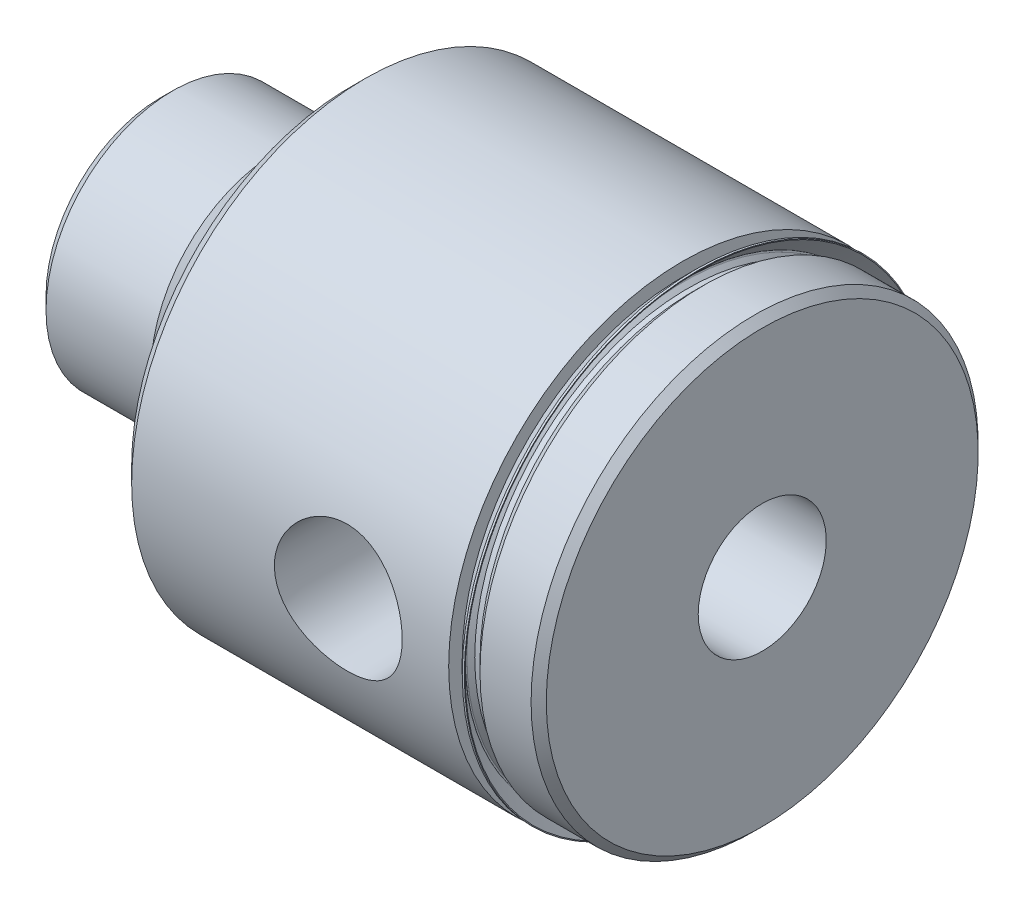
ISO-10303-21;
HEADER;
FILE_DESCRIPTION(('STEP AP214'),'2;1');
FILE_NAME('part.step','',(''),(''),'','','');
FILE_SCHEMA(('AUTOMOTIVE_DESIGN { 1 0 10303 214 1 1 1 1 }'));
ENDSEC;
DATA;
#1=APPLICATION_CONTEXT('core data for automotive mechanical design processes');
#2=APPLICATION_PROTOCOL_DEFINITION('international standard','automotive_design',2000,#1);
#3=PRODUCT_CONTEXT('',#1,'mechanical');
#4=PRODUCT('Part','Part','',(#3));
#5=PRODUCT_RELATED_PRODUCT_CATEGORY('part','',(#4));
#6=PRODUCT_DEFINITION_FORMATION('','',#4);
#7=PRODUCT_DEFINITION_CONTEXT('part definition',#1,'design');
#8=PRODUCT_DEFINITION('design','',#6,#7);
#9=PRODUCT_DEFINITION_SHAPE('','',#8);
#10=(LENGTH_UNIT() NAMED_UNIT(*) SI_UNIT(.MILLI.,.METRE.));
#11=(NAMED_UNIT(*) PLANE_ANGLE_UNIT() SI_UNIT($,.RADIAN.));
#12=(NAMED_UNIT(*) SI_UNIT($,.STERADIAN.) SOLID_ANGLE_UNIT());
#13=UNCERTAINTY_MEASURE_WITH_UNIT(LENGTH_MEASURE(1.E-05),#10,'distance_accuracy_value','');
#14=(GEOMETRIC_REPRESENTATION_CONTEXT(3) GLOBAL_UNCERTAINTY_ASSIGNED_CONTEXT((#13)) GLOBAL_UNIT_ASSIGNED_CONTEXT((#10,
#11,#12)) REPRESENTATION_CONTEXT('',''));
#15=CARTESIAN_POINT('',(0.,0.,0.));
#16=DIRECTION('',(0.,0.,1.));
#17=DIRECTION('',(1.,0.,0.));
#18=AXIS2_PLACEMENT_3D('',#15,#16,#17);
#19=CARTESIAN_POINT('',(52.3367,23.42515,0.));
#20=DIRECTION('',(-1.,0.,0.));
#21=DIRECTION('',(0.,0.,1.));
#22=AXIS2_PLACEMENT_3D('',#19,#20,#21);
#23=PLANE('',#22);
#24=CARTESIAN_POINT('',(52.3367,0.,0.));
#25=DIRECTION('',(-1.,0.,0.));
#26=DIRECTION('',(0.,0.,1.));
#27=AXIS2_PLACEMENT_3D('',#24,#25,#26);
#28=CIRCLE('',#27,23.42515);
#29=CARTESIAN_POINT('',(52.3367,0.,23.42515));
#30=VERTEX_POINT('',#29);
#31=EDGE_CURVE('E220',#30,#30,#28,.T.);
#32=ORIENTED_EDGE('',*,*,#31,.F.);
#33=EDGE_LOOP('',(#32));
#34=FACE_BOUND('',#33,.T.);
#35=CARTESIAN_POINT('',(52.3367,0.,0.));
#36=DIRECTION('',(-1.,0.,0.));
#37=DIRECTION('',(0.,0.,1.));
#38=AXIS2_PLACEMENT_3D('',#35,#36,#37);
#39=CIRCLE('',#38,22.066340711972);
#40=CARTESIAN_POINT('',(52.3367,0.,22.066340711972));
#41=VERTEX_POINT('',#40);
#42=EDGE_CURVE('E11',#41,#41,#39,.F.);
#43=ORIENTED_EDGE('',*,*,#42,.F.);
#44=EDGE_LOOP('',(#43));
#45=FACE_BOUND('',#44,.T.);
#46=ADVANCED_FACE('F38',(#34,#45),#23,.F.);
#47=CARTESIAN_POINT('',(60.325,0.,0.));
#48=DIRECTION('',(-1.,0.,0.));
#49=DIRECTION('',(0.,0.,1.));
#50=AXIS2_PLACEMENT_3D('',#47,#48,#49);
#51=CYLINDRICAL_SURFACE('',#50,21.34235);
#52=CARTESIAN_POINT('',(53.3908,0.,0.));
#53=DIRECTION('',(-1.,0.,0.));
#54=DIRECTION('',(0.,0.,1.));
#55=AXIS2_PLACEMENT_3D('',#52,#53,#54);
#56=CIRCLE('',#55,21.34235);
#57=CARTESIAN_POINT('',(53.3908,0.,21.34235));
#58=VERTEX_POINT('',#57);
#59=EDGE_CURVE('E217',#58,#58,#56,.T.);
#60=ORIENTED_EDGE('',*,*,#59,.T.);
#61=EDGE_LOOP('',(#60));
#62=FACE_BOUND('',#61,.T.);
#63=CARTESIAN_POINT('',(52.86375,0.,0.));
#64=DIRECTION('',(-1.,0.,0.));
#65=DIRECTION('',(0.,0.,1.));
#66=AXIS2_PLACEMENT_3D('',#63,#64,#65);
#67=CIRCLE('',#66,21.34235);
#68=CARTESIAN_POINT('',(52.86375,0.,21.34235));
#69=VERTEX_POINT('',#68);
#70=EDGE_CURVE('E46',#69,#69,#67,.T.);
#71=ORIENTED_EDGE('',*,*,#70,.F.);
#72=EDGE_LOOP('',(#71));
#73=FACE_BOUND('',#72,.T.);
#74=ADVANCED_FACE('F121',(#62,#73),#51,.T.);
#75=CARTESIAN_POINT('',(60.325,0.,0.));
#76=DIRECTION('',(-1.,0.,0.));
#77=DIRECTION('',(0.,0.,1.));
#78=AXIS2_PLACEMENT_3D('',#75,#76,#77);
#79=CYLINDRICAL_SURFACE('',#78,23.42515);
#80=CARTESIAN_POINT('',(20.574,0.,0.));
#81=DIRECTION('',(-1.,0.,0.));
#82=DIRECTION('',(0.,0.,1.));
#83=AXIS2_PLACEMENT_3D('',#80,#81,#82);
#84=CIRCLE('',#83,23.42515);
#85=CARTESIAN_POINT('',(20.574,0.,23.42515));
#86=VERTEX_POINT('',#85);
#87=EDGE_CURVE('E223',#86,#86,#84,.T.);
#88=ORIENTED_EDGE('',*,*,#87,.F.);
#89=EDGE_LOOP('',(#88));
#90=FACE_BOUND('',#89,.T.);
#91=ORIENTED_EDGE('',*,*,#31,.T.);
#92=EDGE_LOOP('',(#91));
#93=FACE_BOUND('',#92,.T.);
#94=CARTESIAN_POINT('',(36.9115790649835,-4.6646689271702,22.9560126398815));
#95=CARTESIAN_POINT('',(37.173715264647,-4.90774911775853,22.9066184768419));
#96=CARTESIAN_POINT('',(37.4564019085562,-5.12892348529612,22.857650792634));
#97=CARTESIAN_POINT('',(38.0555408423936,-5.52143569545501,22.7660323083869));
#98=CARTESIAN_POINT('',(38.3720053279649,-5.69275545408309,22.7233838032794));
#99=CARTESIAN_POINT('',(39.03058577615,-5.98065838622947,22.649317456565));
#100=CARTESIAN_POINT('',(39.3727291776588,-6.09718201391934,22.6179118411787));
#101=CARTESIAN_POINT('',(40.0728635162713,-6.27133040600587,22.57025597372));
#102=CARTESIAN_POINT('',(40.4308497557359,-6.32897250918489,22.5540012603005));
#103=CARTESIAN_POINT('',(40.9669130571281,-6.36947724435374,22.5425686346015));
#104=CARTESIAN_POINT('',(41.1434033341198,-6.37550425760518,22.5408639013015));
#105=CARTESIAN_POINT('',(41.496259171692,-6.37303380583479,22.5415649075011));
#106=CARTESIAN_POINT('',(41.6726247542753,-6.36454166130358,22.543969141285));
#107=CARTESIAN_POINT('',(42.0239742777932,-6.33309615178702,22.5528223637917));
#108=CARTESIAN_POINT('',(42.1989579872367,-6.31014041379934,22.5592720162346));
#109=CARTESIAN_POINT('',(42.5462667308101,-6.24996830625239,22.5760166062224));
#110=CARTESIAN_POINT('',(42.718591823488,-6.21275225120094,22.5863114589623));
#111=CARTESIAN_POINT('',(43.0574337256507,-6.12487030035811,22.6102999211741));
#112=CARTESIAN_POINT('',(43.2239942523839,-6.07436179864199,22.623953642749));
#113=CARTESIAN_POINT('',(43.5522199436666,-5.96010174566731,22.6543225755164));
#114=CARTESIAN_POINT('',(43.7138850822411,-5.89635012415464,22.6710378029501));
#115=CARTESIAN_POINT('',(44.0313192159983,-5.75605574441576,22.7070631671852));
#116=CARTESIAN_POINT('',(44.1870865034301,-5.67950931561084,22.7263740483164));
#117=CARTESIAN_POINT('',(44.4916485863682,-5.51420294692648,22.7670476286511));
#118=CARTESIAN_POINT('',(44.6404456208796,-5.42544696560273,22.7884096621592));
#119=CARTESIAN_POINT('',(44.9341159420751,-5.23374218518952,22.833211345785));
#120=CARTESIAN_POINT('',(45.078775639935,-5.13047553290767,22.8566914546921));
#121=CARTESIAN_POINT('',(45.3588664307492,-4.91239102458285,22.9045524248617));
#122=CARTESIAN_POINT('',(45.4943006183725,-4.79757707436999,22.9289329797979));
#123=CARTESIAN_POINT('',(45.7551952403497,-4.55704646361725,22.9779469900725));
#124=CARTESIAN_POINT('',(45.8806505900842,-4.43132431226278,23.002580567209));
#125=CARTESIAN_POINT('',(46.1206476699085,-4.16986936515539,23.0514103284693));
#126=CARTESIAN_POINT('',(46.2351933410287,-4.03414021602188,23.0756066679624));
#127=CARTESIAN_POINT('',(46.4549962985271,-3.75045311672968,23.123427152109));
#128=CARTESIAN_POINT('',(46.5600001022449,-3.60229461387008,23.1470277151946));
#129=CARTESIAN_POINT('',(46.7570523676465,-3.29741592531777,23.1924220503465));
#130=CARTESIAN_POINT('',(46.8491057638054,-3.14069903238525,23.2142165092821));
#131=CARTESIAN_POINT('',(47.0196134552193,-2.81966723531136,23.2553933887684));
#132=CARTESIAN_POINT('',(47.098063780468,-2.65535013074047,23.274775104705));
#133=CARTESIAN_POINT('',(47.2406546503037,-2.32038381971515,23.3105517885847));
#134=CARTESIAN_POINT('',(47.3048012284645,-2.14973731867559,23.3269480153227));
#135=CARTESIAN_POINT('',(47.4171675359243,-1.80665037543288,23.3559998123606));
#136=CARTESIAN_POINT('',(47.4656717187819,-1.63430871922197,23.3687216915424));
#137=CARTESIAN_POINT('',(47.5479798309191,-1.28598996329867,23.3904748980395));
#138=CARTESIAN_POINT('',(47.5817895876802,-1.11001433379494,23.3995076882793));
#139=CARTESIAN_POINT('',(47.6344277367671,-0.755678625340999,23.4136293555363));
#140=CARTESIAN_POINT('',(47.653256127204,-0.577318546090151,23.4187182320563));
#141=CARTESIAN_POINT('',(47.6757547961973,-0.219576753489858,23.4248039238584));
#142=CARTESIAN_POINT('',(47.6794254244089,-0.0401950638022347,23.4258008335328));
#143=CARTESIAN_POINT('',(47.671705052236,0.312302919608554,23.4237093223638));
#144=CARTESIAN_POINT('',(47.6608060709737,0.485431006511888,23.4207543558632));
#145=CARTESIAN_POINT('',(47.6248919289968,0.830170463792417,23.4110703242019));
#146=CARTESIAN_POINT('',(47.5998719372886,1.0017812946772,23.4043399674326));
#147=CARTESIAN_POINT('',(47.5359410821835,1.34214484107401,23.3872898435868));
#148=CARTESIAN_POINT('',(47.4970354182726,1.510898601674,23.3769714200978));
#149=CARTESIAN_POINT('',(47.4056417387487,1.84451142036912,23.3530171705285));
#150=CARTESIAN_POINT('',(47.3531486315995,2.00936899314414,23.3393801009879));
#151=CARTESIAN_POINT('',(47.2349779146295,2.33411065982915,23.3091439336069));
#152=CARTESIAN_POINT('',(47.1692929252037,2.49399191188287,23.2925431784458));
#153=CARTESIAN_POINT('',(47.0252366512668,2.80770632024413,23.2568134868382));
#154=CARTESIAN_POINT('',(46.946860781801,2.96153726564164,23.2376836371419));
#155=CARTESIAN_POINT('',(46.7780288126827,3.26209809971841,23.1973997906503));
#156=CARTESIAN_POINT('',(46.6875751525095,3.40882941425302,23.176246202855));
#157=CARTESIAN_POINT('',(46.4951677131506,3.69438430953525,23.1324459066244));
#158=CARTESIAN_POINT('',(46.3932098490271,3.83320505488063,23.1097986690143));
#159=CARTESIAN_POINT('',(46.1749610086916,4.10647611887935,23.0628349262649));
#160=CARTESIAN_POINT('',(46.0583093428664,4.24063329069165,23.0384880278792));
#161=CARTESIAN_POINT('',(45.814261783008,4.49873042052272,22.9894831637338));
#162=CARTESIAN_POINT('',(45.6868656782848,4.62267017809162,22.9648251918823));
#163=CARTESIAN_POINT('',(45.4221164599548,4.8595839312779,22.9158621080407));
#164=CARTESIAN_POINT('',(45.2847601786023,4.97255441125729,22.8915571112873));
#165=CARTESIAN_POINT('',(45.0010569166995,5.18671269410995,22.8439859812848));
#166=CARTESIAN_POINT('',(44.8547130562687,5.28790455111046,22.8207194922979));
#167=CARTESIAN_POINT('',(44.5508430282912,5.47981576801484,22.7754076831544));
#168=CARTESIAN_POINT('',(44.3931491910527,5.57027810366473,22.7533971467625));
#169=CARTESIAN_POINT('',(44.0704571646973,5.73756655193374,22.7117901874656));
#170=CARTESIAN_POINT('',(43.9054617868394,5.81439785670793,22.6921928462316));
#171=CARTESIAN_POINT('',(43.5692128032636,5.95388419506915,22.6559950739302));
#172=CARTESIAN_POINT('',(43.3979576279135,6.01653564436625,22.6393954008073));
#173=CARTESIAN_POINT('',(43.0505298177167,6.12709541124189,22.6097243130419));
#174=CARTESIAN_POINT('',(42.8743592761834,6.17500990341377,22.5966514210069));
#175=CARTESIAN_POINT('',(42.5219799433436,6.25488941300702,22.5746692786259));
#176=CARTESIAN_POINT('',(42.3458454109749,6.2871601760874,22.5656804483107));
#177=CARTESIAN_POINT('',(41.9914066042182,6.33689885633314,22.551763446932));
#178=CARTESIAN_POINT('',(41.8131031992946,6.35437251911825,22.5468336997731));
#179=CARTESIAN_POINT('',(41.4555862547044,6.37438221665429,22.5411848081032));
#180=CARTESIAN_POINT('',(41.2763726787628,6.37691765128682,22.5404658327529));
#181=CARTESIAN_POINT('',(40.9183937516925,6.36702621054209,22.5432618851153));
#182=CARTESIAN_POINT('',(40.7396283939778,6.35459955632245,22.5467768502453));
#183=CARTESIAN_POINT('',(40.3885673493516,6.31541912528075,22.5577820901895));
#184=CARTESIAN_POINT('',(40.2162251326654,6.28905060592414,22.5651654223188));
#185=CARTESIAN_POINT('',(39.8743828958246,6.22244338203019,22.5836233574842));
#186=CARTESIAN_POINT('',(39.7048838706891,6.18219992373088,22.5946992255956));
#187=CARTESIAN_POINT('',(39.3699980939354,6.08818289064428,22.6202133108764));
#188=CARTESIAN_POINT('',(39.2046101363913,6.03441333627049,22.6346505288442));
#189=CARTESIAN_POINT('',(38.8789277956555,5.91372954348638,22.6664807132848));
#190=CARTESIAN_POINT('',(38.7186353528117,5.8468103658013,22.6838747900838));
#191=CARTESIAN_POINT('',(38.4023322804641,5.69944149111195,22.7213526502185));
#192=CARTESIAN_POINT('',(38.2463969567359,5.61883783244726,22.7414664399582));
#193=CARTESIAN_POINT('',(37.9418058477153,5.44522061869659,22.7836609149551));
#194=CARTESIAN_POINT('',(37.7931525930499,5.35220279074334,22.8057422765627));
#195=CARTESIAN_POINT('',(37.5041116458698,5.15440386387463,22.8512596697535));
#196=CARTESIAN_POINT('',(37.363723936467,5.04962278899492,22.8746956985688));
#197=CARTESIAN_POINT('',(37.0920828011694,4.82897035392106,22.9222911849558));
#198=CARTESIAN_POINT('',(36.9608295378283,4.7130987964515,22.9464506553908));
#199=CARTESIAN_POINT('',(36.7044005775536,4.46726896943954,22.9955940512509));
#200=CARTESIAN_POINT('',(36.5795348945808,4.336987579946,23.0205805300667));
#201=CARTESIAN_POINT('',(36.3412681175599,4.066302215305,23.0699318419321));
#202=CARTESIAN_POINT('',(36.2278631762699,3.92590166434142,23.0942968815246));
#203=CARTESIAN_POINT('',(36.0132247796964,3.63579107837081,23.1417433141099));
#204=CARTESIAN_POINT('',(35.9119961545093,3.48607738452346,23.1648241957649));
#205=CARTESIAN_POINT('',(35.7225503741013,3.17843882972034,23.209035183506));
#206=CARTESIAN_POINT('',(35.6343280347121,3.0205172744648,23.2301660655783));
#207=CARTESIAN_POINT('',(35.4716197953376,2.69764180329586,23.2698690622335));
#208=CARTESIAN_POINT('',(35.3971199598896,2.53269523341631,23.2884437677587));
#209=CARTESIAN_POINT('',(35.262387804549,2.19683855761282,23.3225218971777));
#210=CARTESIAN_POINT('',(35.2021499386151,2.02593079957294,23.3380265145492));
#211=CARTESIAN_POINT('',(35.0964306057881,1.67933583799598,23.3655237709484));
#212=CARTESIAN_POINT('',(35.0509488240124,1.50364873653283,23.3775164849166));
#213=CARTESIAN_POINT('',(34.9751562871122,1.14881543640923,23.397637645259));
#214=CARTESIAN_POINT('',(34.9448450500002,0.969669347833039,23.4057662144016));
#215=CARTESIAN_POINT('',(34.9004443440414,0.615418929064242,23.4177123233284));
#216=CARTESIAN_POINT('',(34.8858394595635,0.440383649581996,23.4216667536003));
#217=CARTESIAN_POINT('',(34.8711818132543,0.0895971556582394,23.4256355213218));
#218=CARTESIAN_POINT('',(34.8711340888394,-0.0861542855681214,23.4256484948543));
#219=CARTESIAN_POINT('',(34.8856013925534,-0.436941491985833,23.4217311640092));
#220=CARTESIAN_POINT('',(34.9001106492218,-0.611977513207041,23.4178024224181));
#221=CARTESIAN_POINT('',(34.9435604153443,-0.960183960542071,23.4061115361049));
#222=CARTESIAN_POINT('',(34.972506210278,-1.13335367962881,23.3983479874001));
#223=CARTESIAN_POINT('',(35.0439440339135,-1.47350244140592,23.3793702145743));
#224=CARTESIAN_POINT('',(35.0861898827233,-1.64053678993561,23.3682188203505));
#225=CARTESIAN_POINT('',(35.1840349819963,-1.97046068669344,23.3427146676677));
#226=CARTESIAN_POINT('',(35.2396392481198,-2.13334865262037,23.3283607068917));
#227=CARTESIAN_POINT('',(35.3637243910735,-2.45375793763979,23.2968370222049));
#228=CARTESIAN_POINT('',(35.4321977379847,-2.61128233170582,23.2796689456286));
#229=CARTESIAN_POINT('',(35.5815223370151,-2.92007951947145,23.2429561542995));
#230=CARTESIAN_POINT('',(35.6623773881943,-3.07135037625445,23.2234107104824));
#231=CARTESIAN_POINT('',(35.9065502442917,-3.48688483364019,23.1657549610597));
#232=CARTESIAN_POINT('',(36.0834679026856,-3.74302704818475,23.1254702697851));
#233=CARTESIAN_POINT('',(36.4722933068588,-4.22649862979444,23.0420212216894));
#234=CARTESIAN_POINT('',(36.6842055165393,-4.4538243144784,22.9988564979108));
#235=CARTESIAN_POINT('',(36.9115790649835,-4.6646689271702,22.9560126398815));
#236=B_SPLINE_CURVE_WITH_KNOTS('',3,(#94,#95,#96,#97,#98,#99,#100,#101,#102,#103,#104,#105,#106,
#107,#108,#109,#110,#111,#112,#113,#114,#115,#116,#117,#118,#119,#120,#121,#122,#123,#124,#125,
#126,#127,#128,#129,#130,#131,#132,#133,#134,#135,#136,#137,#138,#139,#140,#141,#142,#143,#144,
#145,#146,#147,#148,#149,#150,#151,#152,#153,#154,#155,#156,#157,#158,#159,#160,#161,#162,#163,
#164,#165,#166,#167,#168,#169,#170,#171,#172,#173,#174,#175,#176,#177,#178,#179,#180,#181,#182,
#183,#184,#185,#186,#187,#188,#189,#190,#191,#192,#193,#194,#195,#196,#197,#198,#199,#200,#201,
#202,#203,#204,#205,#206,#207,#208,#209,#210,#211,#212,#213,#214,#215,#216,#217,#218,#219,#220,
#221,#222,#223,#224,#225,#226,#227,#228,#229,#230,#231,#232,#233,#234,#235),.UNSPECIFIED.,.T.,
.F.,(4,2,2,2,2,2,2,2,2,2,2,2,2,2,2,2,2,2,2,2,2,2,2,2,2,2,2,2,2,2,2,2,2,2,2,2,2,2,2,2,2,2,2,2,2,
2,2,2,2,2,2,2,2,2,2,2,2,2,2,2,2,2,2,2,2,2,2,2,2,2,4),(0.,1.08162703675195,2.16364592942584,
3.24683792809954,4.3297108683035,4.85898747965703,5.38807018115937,5.91723971042917,
6.44639756966509,6.9695515558688,7.49270831744929,8.0160154208216,8.53915325678807,
9.07637967586907,9.61342498739689,10.1507422151094,10.6878645993629,11.2365666026064,
11.7850589651584,12.3337111347481,12.8821314334938,13.4199280928428,13.9575112789955,
14.4950945329267,15.0326653859627,15.5525333029312,16.072579181832,16.5924305336547,
17.1124769687919,17.6328151349071,18.1533417096903,18.6737633067981,19.1943702813533,
19.7320704620741,20.2697811891318,20.8076636867861,21.3453604977973,21.894073185994,
22.4425764148393,22.991218136234,23.5396296697482,24.0768412053924,24.6138440494478,
25.1508684665495,25.687884945884,26.2107829553022,26.7338602957374,27.2567823432138,
27.7799011879655,28.3093515281111,28.8389845734883,29.3686165366908,29.8982579226382,
30.4441490984108,30.9898564116915,31.5357794870075,32.0814843713885,32.6266319894549,
33.1715672669128,33.7164909151389,34.2613972493456,34.7878185010751,35.3144219174613,
35.8408166319073,36.3674042106787,36.8847672425692,37.4023248322356,37.9195805276344,
38.4369952510145,39.3750647975297,40.3132540966617),.UNSPECIFIED.);
#237=CARTESIAN_POINT('',(36.9115790649835,-4.6646689271702,22.9560126398815));
#238=VERTEX_POINT('',#237);
#239=EDGE_CURVE('E141',#238,#238,#236,.T.);
#240=ORIENTED_EDGE('',*,*,#239,.F.);
#241=EDGE_LOOP('',(#240));
#242=FACE_BOUND('',#241,.T.);
#243=ADVANCED_FACE('F127',(#90,#93,#242),#79,.T.);
#244=CARTESIAN_POINT('',(0.,0.,0.));
#245=DIRECTION('',(-1.,0.,0.));
#246=DIRECTION('',(0.,0.,1.));
#247=AXIS2_PLACEMENT_3D('',#244,#245,#246);
#248=CYLINDRICAL_SURFACE('',#247,6.4135);
#249=CARTESIAN_POINT('',(0.761999999999985,0.,0.));
#250=DIRECTION('',(-1.,0.,0.));
#251=DIRECTION('',(0.,0.,1.));
#252=AXIS2_PLACEMENT_3D('',#249,#250,#251);
#253=CIRCLE('',#252,6.41350000000001);
#254=CARTESIAN_POINT('',(0.761999999999985,0.,6.41350000000001));
#255=VERTEX_POINT('',#254);
#256=EDGE_CURVE('E202',#255,#255,#253,.T.);
#257=ORIENTED_EDGE('',*,*,#256,.T.);
#258=EDGE_LOOP('',(#257));
#259=FACE_BOUND('',#258,.T.);
#260=CARTESIAN_POINT('',(60.325,0.,0.));
#261=DIRECTION('',(-1.,0.,0.));
#262=DIRECTION('',(0.,0.,1.));
#263=AXIS2_PLACEMENT_3D('',#260,#261,#262);
#264=CIRCLE('',#263,6.4135);
#265=CARTESIAN_POINT('',(60.325,0.,6.4135));
#266=VERTEX_POINT('',#265);
#267=EDGE_CURVE('E205',#266,#266,#264,.T.);
#268=ORIENTED_EDGE('',*,*,#267,.F.);
#269=EDGE_LOOP('',(#268));
#270=FACE_BOUND('',#269,.T.);
#271=CARTESIAN_POINT('',(43.0581569889335,2.56760067617048,5.87710889959757));
#272=CARTESIAN_POINT('',(43.1550700297874,2.52365451711757,5.89629670501323));
#273=CARTESIAN_POINT('',(43.2500841665285,2.47594523422223,5.91656431448984));
#274=CARTESIAN_POINT('',(43.4357127025491,2.37292239429348,5.95863723449564));
#275=CARTESIAN_POINT('',(43.5263208755451,2.3175984763799,5.98044462009417));
#276=CARTESIAN_POINT('',(43.7030380140752,2.19886982424804,6.02511422634235));
#277=CARTESIAN_POINT('',(43.7891004589892,2.13539836708205,6.04798403095827));
#278=CARTESIAN_POINT('',(43.9548884991017,2.00081006814701,6.09383250449289));
#279=CARTESIAN_POINT('',(44.0346181679916,1.92969821164676,6.11681109318538));
#280=CARTESIAN_POINT('',(44.2222735521714,1.74482161575716,6.17266275221915));
#281=CARTESIAN_POINT('',(44.3260311097423,1.62661979246068,6.20515827683111));
#282=CARTESIAN_POINT('',(44.5133835074071,1.37467739961568,6.26577371549754));
#283=CARTESIAN_POINT('',(44.5970508575942,1.24099537356663,6.29390923126156));
#284=CARTESIAN_POINT('',(44.7277125576514,0.983455934841496,6.33875978528466));
#285=CARTESIAN_POINT('',(44.7785105102505,0.861737389261473,6.35660027626806));
#286=CARTESIAN_POINT('',(44.8602018967949,0.610947147033928,6.38557886585986));
#287=CARTESIAN_POINT('',(44.8910998928979,0.48187714313296,6.39671850063208));
#288=CARTESIAN_POINT('',(44.9308806474423,0.219348196354753,6.41109989872246));
#289=CARTESIAN_POINT('',(44.9396714963533,0.0858732601806243,6.41430868894396));
#290=CARTESIAN_POINT('',(44.9342602762142,-0.180540460912537,6.41234196980239));
#291=CARTESIAN_POINT('',(44.9200591261748,-0.313479267048245,6.40716679555383));
#292=CARTESIAN_POINT('',(44.8715518989271,-0.56544162519477,6.38968843305731));
#293=CARTESIAN_POINT('',(44.8387100093376,-0.684790510266683,6.37790503497479));
#294=CARTESIAN_POINT('',(44.7560933649552,-0.916646415822547,6.34873351474481));
#295=CARTESIAN_POINT('',(44.7063187186818,-1.02915348014929,6.33134542851704));
#296=CARTESIAN_POINT('',(44.5729889103057,-1.28201512471041,6.28577731928621));
#297=CARTESIAN_POINT('',(44.4837030485962,-1.41905081116568,6.25593377049188));
#298=CARTESIAN_POINT('',(44.2842374355751,-1.67633620192813,6.19197806736053));
#299=CARTESIAN_POINT('',(44.1739741734644,-1.79651536019591,6.1578490437999));
#300=CARTESIAN_POINT('',(43.909189589516,-2.04535522198943,6.08031727731215));
#301=CARTESIAN_POINT('',(43.7503591292428,-2.16935817786818,6.03662196306322));
#302=CARTESIAN_POINT('',(43.4991517416543,-2.33436001130003,5.97387351357465));
#303=CARTESIAN_POINT('',(43.4136260209416,-2.38569496769636,5.95349967870984));
#304=CARTESIAN_POINT('',(43.2386935859232,-2.48164582971385,5.91414215184982));
#305=CARTESIAN_POINT('',(43.1492909178029,-2.52626853306011,5.8951570635743));
#306=CARTESIAN_POINT('',(43.0581569889335,-2.56760067617048,5.87710889959757));
#307=B_SPLINE_CURVE_WITH_KNOTS('',3,(#271,#272,#273,#274,#275,#276,#277,#278,#279,#280,#281,
#282,#283,#284,#285,#286,#287,#288,#289,#290,#291,#292,#293,#294,#295,#296,#297,#298,#299,#300,
#301,#302,#303,#304,#305,#306),.UNSPECIFIED.,.F.,.F.,(4,2,2,2,2,2,2,2,2,2,2,2,2,2,2,2,2,4),(0.,
0.32432320404157,0.649092144331099,0.976714301632612,1.30412397290979,1.7840620880873,
2.26224104632181,2.659863400343,3.05739456510914,3.45657573683535,3.8557409533285,
4.22719492180845,4.59864650973828,5.09470382571592,5.59277890643596,6.20804696278619,
6.5132310288998,6.81810391328587),.UNSPECIFIED.);
#308=CARTESIAN_POINT('',(43.2913713371446,2.45252352297418,5.9260535450887));
#309=VERTEX_POINT('',#308);
#310=CARTESIAN_POINT('',(43.2913713371446,-2.45252352297418,5.9260535450887));
#311=VERTEX_POINT('',#310);
#312=EDGE_CURVE('E58',#309,#311,#307,.T.);
#313=ORIENTED_EDGE('',*,*,#312,.F.);
#314=CARTESIAN_POINT('',(39.2586286628554,2.45252352297418,5.9260535450887));
#315=CARTESIAN_POINT('',(39.3900803682707,2.5606628663766,5.88129097334746));
#316=CARTESIAN_POINT('',(39.5306509751881,2.65844249580449,5.8373530798441));
#317=CARTESIAN_POINT('',(39.8277676505558,2.83121217786747,5.75555947310495));
#318=CARTESIAN_POINT('',(39.9843932730945,2.90608061687659,5.71773670270764));
#319=CARTESIAN_POINT('',(40.3105303146843,3.03000652784714,5.65305037282821));
#320=CARTESIAN_POINT('',(40.4800876905457,3.07896652142699,5.62622828641907));
#321=CARTESIAN_POINT('',(40.8262388585051,3.14805338768533,5.58787674501058));
#322=CARTESIAN_POINT('',(41.0028100338683,3.16826625341971,5.57630168833266));
#323=CARTESIAN_POINT('',(41.3416791973238,3.1784255802067,5.57051120186788));
#324=CARTESIAN_POINT('',(41.5038832736707,3.17085094492093,5.57487383181212));
#325=CARTESIAN_POINT('',(41.8244547100361,3.13126695360916,5.59720023532742));
#326=CARTESIAN_POINT('',(41.9828180543478,3.09923307194143,5.61517766050408));
#327=CARTESIAN_POINT('',(42.2873082117167,3.01335066842215,5.66171253367837));
#328=CARTESIAN_POINT('',(42.4336438695629,2.96007806300493,5.68998908322225));
#329=CARTESIAN_POINT('',(42.7155520865153,2.8335978344692,5.75401583794416));
#330=CARTESIAN_POINT('',(42.8511316629258,2.76040334890057,5.78976111424913));
#331=CARTESIAN_POINT('',(43.034482104158,2.64367099753208,5.84340934015542));
#332=CARTESIAN_POINT('',(43.0876012188596,2.60753250870087,5.85964570852087));
#333=CARTESIAN_POINT('',(43.1913441693311,2.53225993312652,5.89256526080689));
#334=CARTESIAN_POINT('',(43.2419730976116,2.49313241673749,5.90924741512439));
#335=CARTESIAN_POINT('',(43.2913713371446,2.45252352297418,5.9260535450887));
#336=B_SPLINE_CURVE_WITH_KNOTS('',3,(#314,#315,#316,#317,#318,#319,#320,#321,#322,#323,#324,
#325,#326,#327,#328,#329,#330,#331,#332,#333,#334,#335),.UNSPECIFIED.,.F.,.F.,(4,2,2,2,2,2,2,2,
2,2,4),(0.,0.527864522220265,1.05848422448743,1.59108639475862,2.12209198399069,
2.60692554245214,3.09224589003603,3.56521513665775,4.03787323469485,4.23658144503527,
4.4348647809417),.UNSPECIFIED.);
#337=CARTESIAN_POINT('',(39.2586286628554,2.45252352297418,5.9260535450887));
#338=VERTEX_POINT('',#337);
#339=EDGE_CURVE('E71',#338,#309,#336,.T.);
#340=ORIENTED_EDGE('',*,*,#339,.F.);
#341=CARTESIAN_POINT('',(39.4918430110665,-2.56760067617048,5.87710889959757));
#342=CARTESIAN_POINT('',(39.3949299702126,-2.52365451711757,5.89629670501323));
#343=CARTESIAN_POINT('',(39.2999158334715,-2.47594523422223,5.91656431448984));
#344=CARTESIAN_POINT('',(39.1142872974509,-2.37292239429348,5.95863723449564));
#345=CARTESIAN_POINT('',(39.0236791244549,-2.3175984763799,5.98044462009417));
#346=CARTESIAN_POINT('',(38.8469619859248,-2.19886982424804,6.02511422634235));
#347=CARTESIAN_POINT('',(38.7608995410108,-2.13539836708205,6.04798403095827));
#348=CARTESIAN_POINT('',(38.5951115008982,-2.00081006814701,6.09383250449289));
#349=CARTESIAN_POINT('',(38.5153818320084,-1.92969821164676,6.11681109318538));
#350=CARTESIAN_POINT('',(38.3277264478286,-1.74482161575717,6.17266275221915));
#351=CARTESIAN_POINT('',(38.2239688902577,-1.62661979246068,6.20515827683111));
#352=CARTESIAN_POINT('',(38.0366164925929,-1.37467739961569,6.26577371549754));
#353=CARTESIAN_POINT('',(37.9529491424058,-1.24099537356664,6.29390923126156));
#354=CARTESIAN_POINT('',(37.8222874423486,-0.983455934841503,6.33875978528465));
#355=CARTESIAN_POINT('',(37.7714894897495,-0.861737389261476,6.35660027626805));
#356=CARTESIAN_POINT('',(37.6897981032051,-0.61094714703393,6.38557886585986));
#357=CARTESIAN_POINT('',(37.6589001071021,-0.481877143132963,6.39671850063208));
#358=CARTESIAN_POINT('',(37.6191193525577,-0.219348196354757,6.41109989872246));
#359=CARTESIAN_POINT('',(37.6103285036467,-0.0858732601806276,6.41430868894396));
#360=CARTESIAN_POINT('',(37.6157397237858,0.180540460912535,6.41234196980239));
#361=CARTESIAN_POINT('',(37.6299408738252,0.313479267048243,6.40716679555383));
#362=CARTESIAN_POINT('',(37.6784481010729,0.565441625194769,6.38968843305731));
#363=CARTESIAN_POINT('',(37.7112899906624,0.684790510266682,6.37790503497479));
#364=CARTESIAN_POINT('',(37.7939066350448,0.916646415822546,6.34873351474481));
#365=CARTESIAN_POINT('',(37.8436812813182,1.02915348014929,6.33134542851704));
#366=CARTESIAN_POINT('',(37.9770110896943,1.28201512471041,6.28577731928621));
#367=CARTESIAN_POINT('',(38.0662969514038,1.41905081116568,6.25593377049188));
#368=CARTESIAN_POINT('',(38.2657625644249,1.67633620192813,6.19197806736053));
#369=CARTESIAN_POINT('',(38.3760258265356,1.79651536019591,6.1578490437999));
#370=CARTESIAN_POINT('',(38.640810410484,2.04535522198943,6.08031727731215));
#371=CARTESIAN_POINT('',(38.7996408707572,2.16935817786818,6.03662196306322));
#372=CARTESIAN_POINT('',(39.0508482583457,2.33436001130003,5.97387351357465));
#373=CARTESIAN_POINT('',(39.1363739790584,2.38569496769636,5.95349967870984));
#374=CARTESIAN_POINT('',(39.3113064140768,2.48164582971385,5.91414215184982));
#375=CARTESIAN_POINT('',(39.4007090821971,2.52626853306011,5.8951570635743));
#376=CARTESIAN_POINT('',(39.4918430110665,2.56760067617048,5.87710889959757));
#377=B_SPLINE_CURVE_WITH_KNOTS('',3,(#341,#342,#343,#344,#345,#346,#347,#348,#349,#350,#351,
#352,#353,#354,#355,#356,#357,#358,#359,#360,#361,#362,#363,#364,#365,#366,#367,#368,#369,#370,
#371,#372,#373,#374,#375,#376),.UNSPECIFIED.,.F.,.F.,(4,2,2,2,2,2,2,2,2,2,2,2,2,2,2,2,2,4),(0.,
0.32432320404157,0.649092144331099,0.976714301632612,1.30412397290979,1.7840620880873,
2.2622410463218,2.65986340034299,3.05739456510914,3.45657573683535,3.8557409533285,
4.22719492180845,4.59864650973828,5.09470382571592,5.59277890643595,6.20804696278619,
6.5132310288998,6.81810391328587),.UNSPECIFIED.);
#378=CARTESIAN_POINT('',(39.2586286628554,-2.45252352297418,5.9260535450887));
#379=VERTEX_POINT('',#378);
#380=EDGE_CURVE('E64',#379,#338,#377,.T.);
#381=ORIENTED_EDGE('',*,*,#380,.F.);
#382=CARTESIAN_POINT('',(43.2913713371446,-2.45252352297418,5.9260535450887));
#383=CARTESIAN_POINT('',(43.1599196317293,-2.5606628663766,5.88129097334746));
#384=CARTESIAN_POINT('',(43.0193490248119,-2.65844249580449,5.8373530798441));
#385=CARTESIAN_POINT('',(42.7222323494442,-2.83121217786747,5.75555947310495));
#386=CARTESIAN_POINT('',(42.5656067269055,-2.90608061687659,5.71773670270764));
#387=CARTESIAN_POINT('',(42.2394696853157,-3.03000652784714,5.65305037282821));
#388=CARTESIAN_POINT('',(42.0699123094543,-3.07896652142699,5.62622828641907));
#389=CARTESIAN_POINT('',(41.7237611414949,-3.14805338768533,5.58787674501058));
#390=CARTESIAN_POINT('',(41.5471899661317,-3.16826625341971,5.57630168833266));
#391=CARTESIAN_POINT('',(41.2083208026762,-3.1784255802067,5.57051120186788));
#392=CARTESIAN_POINT('',(41.0461167263293,-3.17085094492093,5.57487383181212));
#393=CARTESIAN_POINT('',(40.725545289964,-3.13126695360916,5.59720023532742));
#394=CARTESIAN_POINT('',(40.5671819456522,-3.09923307194143,5.61517766050408));
#395=CARTESIAN_POINT('',(40.2626917882832,-3.01335066842215,5.66171253367837));
#396=CARTESIAN_POINT('',(40.1163561304371,-2.96007806300493,5.68998908322225));
#397=CARTESIAN_POINT('',(39.8344479134847,-2.8335978344692,5.75401583794416));
#398=CARTESIAN_POINT('',(39.6988683370742,-2.76040334890057,5.78976111424913));
#399=CARTESIAN_POINT('',(39.515517895842,-2.64367099753208,5.84340934015542));
#400=CARTESIAN_POINT('',(39.4623987811404,-2.60753250870087,5.85964570852087));
#401=CARTESIAN_POINT('',(39.3586558306689,-2.53225993312652,5.89256526080689));
#402=CARTESIAN_POINT('',(39.3080269023884,-2.49313241673749,5.90924741512439));
#403=CARTESIAN_POINT('',(39.2586286628554,-2.45252352297418,5.9260535450887));
#404=B_SPLINE_CURVE_WITH_KNOTS('',3,(#382,#383,#384,#385,#386,#387,#388,#389,#390,#391,#392,
#393,#394,#395,#396,#397,#398,#399,#400,#401,#402,#403),.UNSPECIFIED.,.F.,.F.,(4,2,2,2,2,2,2,2,
2,2,4),(0.,0.527864522220265,1.05848422448743,1.59108639475862,2.12209198399069,
2.60692554245214,3.09224589003603,3.56521513665775,4.03787323469485,4.23658144503527,
4.4348647809417),.UNSPECIFIED.);
#405=EDGE_CURVE('E79',#311,#379,#404,.T.);
#406=ORIENTED_EDGE('',*,*,#405,.F.);
#407=EDGE_LOOP('',(#313,#340,#381,#406));
#408=FACE_BOUND('',#407,.T.);
#409=ADVANCED_FACE('F78',(#259,#270,#408),#248,.F.);
#410=CARTESIAN_POINT('',(19.05,0.,0.));
#411=DIRECTION('',(-1.,0.,0.));
#412=DIRECTION('',(0.,0.,1.));
#413=AXIS2_PLACEMENT_3D('',#410,#411,#412);
#414=CYLINDRICAL_SURFACE('',#413,13.08735);
#415=CARTESIAN_POINT('',(16.6624,0.,0.));
#416=DIRECTION('',(-1.,0.,0.));
#417=DIRECTION('',(0.,0.,1.));
#418=AXIS2_PLACEMENT_3D('',#415,#416,#417);
#419=CIRCLE('',#418,13.08735);
#420=CARTESIAN_POINT('',(16.6624,0.,13.08735));
#421=VERTEX_POINT('',#420);
#422=EDGE_CURVE('E72',#421,#421,#419,.T.);
#423=ORIENTED_EDGE('',*,*,#422,.F.);
#424=EDGE_LOOP('',(#423));
#425=FACE_BOUND('',#424,.T.);
#426=CARTESIAN_POINT('',(19.05,0.,0.));
#427=DIRECTION('',(1.,0.,0.));
#428=DIRECTION('',(0.,0.,-1.));
#429=AXIS2_PLACEMENT_3D('',#426,#427,#428);
#430=CIRCLE('',#429,13.08735);
#431=CARTESIAN_POINT('',(19.05,0.,-13.08735));
#432=VERTEX_POINT('',#431);
#433=EDGE_CURVE('E229',#432,#432,#430,.T.);
#434=ORIENTED_EDGE('',*,*,#433,.F.);
#435=EDGE_LOOP('',(#434));
#436=FACE_BOUND('',#435,.T.);
#437=ADVANCED_FACE('F40',(#425,#436),#414,.T.);
#438=CARTESIAN_POINT('',(16.6624,12.4650500000012,0.));
#439=DIRECTION('',(1.,0.,0.));
#440=DIRECTION('',(0.,0.,-1.));
#441=AXIS2_PLACEMENT_3D('',#438,#439,#440);
#442=PLANE('',#441);
#443=CARTESIAN_POINT('',(16.6624,0.,0.));
#444=DIRECTION('',(-1.,0.,0.));
#445=DIRECTION('',(0.,0.,1.));
#446=AXIS2_PLACEMENT_3D('',#443,#444,#445);
#447=CIRCLE('',#446,12.4650500000012);
#448=CARTESIAN_POINT('',(16.6624,0.,12.4650500000012));
#449=VERTEX_POINT('',#448);
#450=EDGE_CURVE('E250',#449,#449,#447,.T.);
#451=ORIENTED_EDGE('',*,*,#450,.F.);
#452=EDGE_LOOP('',(#451));
#453=FACE_BOUND('',#452,.T.);
#454=ORIENTED_EDGE('',*,*,#422,.T.);
#455=EDGE_LOOP('',(#454));
#456=FACE_BOUND('',#455,.T.);
#457=ADVANCED_FACE('F255',(#453,#456),#442,.F.);
#458=CARTESIAN_POINT('',(15.4939999999988,0.,0.));
#459=DIRECTION('',(-1.,0.,0.));
#460=DIRECTION('',(0.,0.,1.));
#461=AXIS2_PLACEMENT_3D('',#458,#459,#460);
#462=TOROIDAL_SURFACE('',#461,12.4650500000012,1.16840000000124);
#463=CARTESIAN_POINT('',(15.4939999999988,0.,0.));
#464=DIRECTION('',(-1.,0.,0.));
#465=DIRECTION('',(0.,0.,1.));
#466=AXIS2_PLACEMENT_3D('',#463,#464,#465);
#467=CIRCLE('',#466,11.29665);
#468=CARTESIAN_POINT('',(15.4939999999988,0.,11.29665));
#469=VERTEX_POINT('',#468);
#470=EDGE_CURVE('E247',#469,#469,#467,.T.);
#471=ORIENTED_EDGE('',*,*,#470,.F.);
#472=EDGE_LOOP('',(#471));
#473=FACE_BOUND('',#472,.T.);
#474=ORIENTED_EDGE('',*,*,#450,.T.);
#475=EDGE_LOOP('',(#474));
#476=FACE_BOUND('',#475,.T.);
#477=ADVANCED_FACE('F293',(#473,#476),#462,.F.);
#478=CARTESIAN_POINT('',(19.05,0.,0.));
#479=DIRECTION('',(-1.,0.,0.));
#480=DIRECTION('',(0.,0.,1.));
#481=AXIS2_PLACEMENT_3D('',#478,#479,#480);
#482=CYLINDRICAL_SURFACE('',#481,11.29665);
#483=CARTESIAN_POINT('',(13.8811000000004,0.,0.));
#484=DIRECTION('',(-1.,0.,0.));
#485=DIRECTION('',(0.,0.,1.));
#486=AXIS2_PLACEMENT_3D('',#483,#484,#485);
#487=CIRCLE('',#486,11.29665);
#488=CARTESIAN_POINT('',(13.8811000000004,0.,11.29665));
#489=VERTEX_POINT('',#488);
#490=EDGE_CURVE('E244',#489,#489,#487,.T.);
#491=ORIENTED_EDGE('',*,*,#490,.F.);
#492=EDGE_LOOP('',(#491));
#493=FACE_BOUND('',#492,.T.);
#494=ORIENTED_EDGE('',*,*,#470,.T.);
#495=EDGE_LOOP('',(#494));
#496=FACE_BOUND('',#495,.T.);
#497=ADVANCED_FACE('F289',(#493,#496),#482,.T.);
#498=CARTESIAN_POINT('',(13.8811000000004,0.,0.));
#499=DIRECTION('',(-1.,0.,0.));
#500=DIRECTION('',(0.,0.,1.));
#501=AXIS2_PLACEMENT_3D('',#498,#499,#500);
#502=TOROIDAL_SURFACE('',#501,12.4650499999991,1.16839999999909);
#503=CARTESIAN_POINT('',(13.1291506640036,0.,0.));
#504=DIRECTION('',(-1.,0.,0.));
#505=DIRECTION('',(0.,0.,1.));
#506=AXIS2_PLACEMENT_3D('',#503,#504,#505);
#507=CIRCLE('',#506,11.5707733335855);
#508=CARTESIAN_POINT('',(13.1291506640036,0.,11.5707733335855));
#509=VERTEX_POINT('',#508);
#510=EDGE_CURVE('E241',#509,#509,#507,.T.);
#511=ORIENTED_EDGE('',*,*,#510,.F.);
#512=EDGE_LOOP('',(#511));
#513=FACE_BOUND('',#512,.T.);
#514=ORIENTED_EDGE('',*,*,#490,.T.);
#515=EDGE_LOOP('',(#514));
#516=FACE_BOUND('',#515,.T.);
#517=ADVANCED_FACE('F285',(#513,#516),#502,.F.);
#518=CARTESIAN_POINT('',(13.1291506640036,0.,0.));
#519=DIRECTION('',(-1.,0.,0.));
#520=DIRECTION('',(0.,0.,1.));
#521=AXIS2_PLACEMENT_3D('',#518,#519,#520);
#522=CONICAL_SURFACE('',#521,11.5707733335855,0.69915587895082);
#523=CARTESIAN_POINT('',(11.786186436862,0.,0.));
#524=DIRECTION('',(-1.,0.,0.));
#525=DIRECTION('',(0.,0.,1.));
#526=AXIS2_PLACEMENT_3D('',#523,#524,#525);
#527=CIRCLE('',#526,12.7);
#528=CARTESIAN_POINT('',(11.786186436862,0.,12.7));
#529=VERTEX_POINT('',#528);
#530=EDGE_CURVE('E238',#529,#529,#527,.T.);
#531=ORIENTED_EDGE('',*,*,#530,.F.);
#532=EDGE_LOOP('',(#531));
#533=FACE_BOUND('',#532,.T.);
#534=ORIENTED_EDGE('',*,*,#510,.T.);
#535=EDGE_LOOP('',(#534));
#536=FACE_BOUND('',#535,.T.);
#537=ADVANCED_FACE('F281',(#533,#536),#522,.T.);
#538=CARTESIAN_POINT('',(19.05,0.,0.));
#539=DIRECTION('',(-1.,0.,0.));
#540=DIRECTION('',(0.,0.,1.));
#541=AXIS2_PLACEMENT_3D('',#538,#539,#540);
#542=CYLINDRICAL_SURFACE('',#541,12.7);
#543=CARTESIAN_POINT('',(1.26873,0.,0.));
#544=DIRECTION('',(-1.,0.,0.));
#545=DIRECTION('',(0.,0.,1.));
#546=AXIS2_PLACEMENT_3D('',#543,#544,#545);
#547=CIRCLE('',#546,12.7);
#548=CARTESIAN_POINT('',(1.26873,0.,12.7));
#549=VERTEX_POINT('',#548);
#550=EDGE_CURVE('E235',#549,#549,#547,.T.);
#551=ORIENTED_EDGE('',*,*,#550,.F.);
#552=EDGE_LOOP('',(#551));
#553=FACE_BOUND('',#552,.T.);
#554=ORIENTED_EDGE('',*,*,#530,.T.);
#555=EDGE_LOOP('',(#554));
#556=FACE_BOUND('',#555,.T.);
#557=ADVANCED_FACE('F277',(#553,#556),#542,.T.);
#558=CARTESIAN_POINT('',(1.26873,0.,0.));
#559=DIRECTION('',(1.,0.,0.));
#560=DIRECTION('',(0.,0.,-1.));
#561=AXIS2_PLACEMENT_3D('',#558,#559,#560);
#562=CONICAL_SURFACE('',#561,12.7,0.785398163397448);
#563=CARTESIAN_POINT('',(0.,0.,0.));
#564=DIRECTION('',(-1.,0.,0.));
#565=DIRECTION('',(0.,0.,1.));
#566=AXIS2_PLACEMENT_3D('',#563,#564,#565);
#567=CIRCLE('',#566,11.43127);
#568=CARTESIAN_POINT('',(0.,0.,11.43127));
#569=VERTEX_POINT('',#568);
#570=EDGE_CURVE('E232',#569,#569,#567,.T.);
#571=ORIENTED_EDGE('',*,*,#570,.F.);
#572=EDGE_LOOP('',(#571));
#573=FACE_BOUND('',#572,.T.);
#574=ORIENTED_EDGE('',*,*,#550,.T.);
#575=EDGE_LOOP('',(#574));
#576=FACE_BOUND('',#575,.T.);
#577=ADVANCED_FACE('F271',(#573,#576),#562,.T.);
#578=CARTESIAN_POINT('',(0.,0.,0.));
#579=DIRECTION('',(1.,0.,0.));
#580=DIRECTION('',(0.,0.,-1.));
#581=AXIS2_PLACEMENT_3D('',#578,#579,#580);
#582=PLANE('',#581);
#583=CARTESIAN_POINT('',(0.,0.,0.));
#584=DIRECTION('',(-1.,0.,0.));
#585=DIRECTION('',(0.,0.,1.));
#586=AXIS2_PLACEMENT_3D('',#583,#584,#585);
#587=CIRCLE('',#586,7.1755);
#588=CARTESIAN_POINT('',(0.,0.,7.1755));
#589=VERTEX_POINT('',#588);
#590=EDGE_CURVE('E76',#589,#589,#587,.T.);
#591=ORIENTED_EDGE('',*,*,#590,.F.);
#592=EDGE_LOOP('',(#591));
#593=FACE_BOUND('',#592,.T.);
#594=ORIENTED_EDGE('',*,*,#570,.T.);
#595=EDGE_LOOP('',(#594));
#596=FACE_BOUND('',#595,.T.);
#597=ADVANCED_FACE('F263',(#593,#596),#582,.F.);
#598=CARTESIAN_POINT('',(19.05,0.,0.));
#599=DIRECTION('',(1.,0.,0.));
#600=DIRECTION('',(0.,0.,-1.));
#601=AXIS2_PLACEMENT_3D('',#598,#599,#600);
#602=PLANE('',#601);
#603=CARTESIAN_POINT('',(19.05,0.,0.));
#604=DIRECTION('',(-1.,0.,0.));
#605=DIRECTION('',(0.,0.,1.));
#606=AXIS2_PLACEMENT_3D('',#603,#604,#605);
#607=CIRCLE('',#606,21.90115);
#608=CARTESIAN_POINT('',(19.05,0.,21.90115));
#609=VERTEX_POINT('',#608);
#610=EDGE_CURVE('E226',#609,#609,#607,.T.);
#611=ORIENTED_EDGE('',*,*,#610,.T.);
#612=EDGE_LOOP('',(#611));
#613=FACE_BOUND('',#612,.T.);
#614=ORIENTED_EDGE('',*,*,#433,.T.);
#615=EDGE_LOOP('',(#614));
#616=FACE_BOUND('',#615,.T.);
#617=ADVANCED_FACE('F261',(#613,#616),#602,.F.);
#618=CARTESIAN_POINT('',(20.574,0.,0.));
#619=DIRECTION('',(1.,0.,0.));
#620=DIRECTION('',(0.,0.,-1.));
#621=AXIS2_PLACEMENT_3D('',#618,#619,#620);
#622=CONICAL_SURFACE('',#621,23.42515,0.785398163397446);
#623=ORIENTED_EDGE('',*,*,#610,.F.);
#624=EDGE_LOOP('',(#623));
#625=FACE_BOUND('',#624,.T.);
#626=ORIENTED_EDGE('',*,*,#87,.T.);
#627=EDGE_LOOP('',(#626));
#628=FACE_BOUND('',#627,.T.);
#629=ADVANCED_FACE('F138',(#625,#628),#622,.T.);
#630=CARTESIAN_POINT('',(54.4449,0.,0.));
#631=DIRECTION('',(1.,0.,0.));
#632=DIRECTION('',(0.,0.,-1.));
#633=AXIS2_PLACEMENT_3D('',#630,#631,#632);
#634=CONICAL_SURFACE('',#633,22.39645,0.785398163397452);
#635=ORIENTED_EDGE('',*,*,#59,.F.);
#636=EDGE_LOOP('',(#635));
#637=FACE_BOUND('',#636,.T.);
#638=CARTESIAN_POINT('',(54.4449,0.,0.));
#639=DIRECTION('',(-1.,0.,0.));
#640=DIRECTION('',(0.,0.,1.));
#641=AXIS2_PLACEMENT_3D('',#638,#639,#640);
#642=CIRCLE('',#641,22.39645);
#643=CARTESIAN_POINT('',(54.4449,0.,22.39645));
#644=VERTEX_POINT('',#643);
#645=EDGE_CURVE('E214',#644,#644,#642,.T.);
#646=ORIENTED_EDGE('',*,*,#645,.T.);
#647=EDGE_LOOP('',(#646));
#648=FACE_BOUND('',#647,.T.);
#649=ADVANCED_FACE('F269',(#637,#648),#634,.T.);
#650=CARTESIAN_POINT('',(60.325,0.,0.));
#651=DIRECTION('',(-1.,0.,0.));
#652=DIRECTION('',(0.,0.,1.));
#653=AXIS2_PLACEMENT_3D('',#650,#651,#652);
#654=CYLINDRICAL_SURFACE('',#653,22.39645);
#655=ORIENTED_EDGE('',*,*,#645,.F.);
#656=EDGE_LOOP('',(#655));
#657=FACE_BOUND('',#656,.T.);
#658=CARTESIAN_POINT('',(59.563,0.,0.));
#659=DIRECTION('',(-1.,0.,0.));
#660=DIRECTION('',(0.,0.,1.));
#661=AXIS2_PLACEMENT_3D('',#658,#659,#660);
#662=CIRCLE('',#661,22.39645);
#663=CARTESIAN_POINT('',(59.563,0.,22.39645));
#664=VERTEX_POINT('',#663);
#665=EDGE_CURVE('E211',#664,#664,#662,.T.);
#666=ORIENTED_EDGE('',*,*,#665,.T.);
#667=EDGE_LOOP('',(#666));
#668=FACE_BOUND('',#667,.T.);
#669=ADVANCED_FACE('F393',(#657,#668),#654,.T.);
#670=CARTESIAN_POINT('',(60.325,0.,0.));
#671=DIRECTION('',(-1.,0.,0.));
#672=DIRECTION('',(0.,0.,1.));
#673=AXIS2_PLACEMENT_3D('',#670,#671,#672);
#674=CONICAL_SURFACE('',#673,21.63445,0.785398163397448);
#675=ORIENTED_EDGE('',*,*,#665,.F.);
#676=EDGE_LOOP('',(#675));
#677=FACE_BOUND('',#676,.T.);
#678=CARTESIAN_POINT('',(60.325,0.,0.));
#679=DIRECTION('',(-1.,0.,0.));
#680=DIRECTION('',(0.,0.,1.));
#681=AXIS2_PLACEMENT_3D('',#678,#679,#680);
#682=CIRCLE('',#681,21.63445);
#683=CARTESIAN_POINT('',(60.325,0.,21.63445));
#684=VERTEX_POINT('',#683);
#685=EDGE_CURVE('E208',#684,#684,#682,.T.);
#686=ORIENTED_EDGE('',*,*,#685,.T.);
#687=EDGE_LOOP('',(#686));
#688=FACE_BOUND('',#687,.T.);
#689=ADVANCED_FACE('F116',(#677,#688),#674,.T.);
#690=CARTESIAN_POINT('',(60.325,21.63445,0.));
#691=DIRECTION('',(-1.,0.,0.));
#692=DIRECTION('',(0.,0.,1.));
#693=AXIS2_PLACEMENT_3D('',#690,#691,#692);
#694=PLANE('',#693);
#695=ORIENTED_EDGE('',*,*,#267,.T.);
#696=EDGE_LOOP('',(#695));
#697=FACE_BOUND('',#696,.T.);
#698=ORIENTED_EDGE('',*,*,#685,.F.);
#699=EDGE_LOOP('',(#698));
#700=FACE_BOUND('',#699,.T.);
#701=ADVANCED_FACE('F109',(#697,#700),#694,.F.);
#702=CARTESIAN_POINT('',(0.,0.,0.));
#703=DIRECTION('',(-1.,0.,0.));
#704=DIRECTION('',(0.,0.,1.));
#705=AXIS2_PLACEMENT_3D('',#702,#703,#704);
#706=CONICAL_SURFACE('',#705,7.1755,0.785398163397452);
#707=ORIENTED_EDGE('',*,*,#256,.F.);
#708=EDGE_LOOP('',(#707));
#709=FACE_BOUND('',#708,.T.);
#710=ORIENTED_EDGE('',*,*,#590,.T.);
#711=EDGE_LOOP('',(#710));
#712=FACE_BOUND('',#711,.T.);
#713=ADVANCED_FACE('F106',(#709,#712),#706,.F.);
#714=CARTESIAN_POINT('',(41.275,0.,23.42515));
#715=DIRECTION('',(0.,0.,1.));
#716=DIRECTION('',(1.,0.,0.));
#717=AXIS2_PLACEMENT_3D('',#714,#715,#716);
#718=CONICAL_SURFACE('',#717,6.402022745908,0.0312094049979957);
#719=CARTESIAN_POINT('',(41.275,0.,8.69315));
#720=DIRECTION('',(0.,0.,-1.));
#721=DIRECTION('',(-1.,0.,0.));
#722=AXIS2_PLACEMENT_3D('',#719,#720,#721);
#723=CIRCLE('',#722,5.94209645491101);
#724=CARTESIAN_POINT('',(35.332903545089,0.,8.69315));
#725=VERTEX_POINT('',#724);
#726=EDGE_CURVE('E197',#725,#725,#723,.T.);
#727=ORIENTED_EDGE('',*,*,#726,.T.);
#728=EDGE_LOOP('',(#727));
#729=FACE_BOUND('',#728,.T.);
#730=ORIENTED_EDGE('',*,*,#239,.T.);
#731=EDGE_LOOP('',(#730));
#732=FACE_BOUND('',#731,.T.);
#733=ADVANCED_FACE('F102',(#729,#732),#718,.F.);
#734=CARTESIAN_POINT('',(41.275,0.,23.42515));
#735=DIRECTION('',(0.,0.,-1.));
#736=DIRECTION('',(-1.,0.,0.));
#737=AXIS2_PLACEMENT_3D('',#734,#735,#736);
#738=CYLINDRICAL_SURFACE('',#737,3.175);
#739=ORIENTED_EDGE('',*,*,#405,.T.);
#740=CARTESIAN_POINT('',(41.275,0.,5.9260535450887));
#741=DIRECTION('',(0.,0.,-1.));
#742=DIRECTION('',(-1.,0.,0.));
#743=AXIS2_PLACEMENT_3D('',#740,#741,#742);
#744=CIRCLE('',#743,3.175);
#745=EDGE_CURVE('E53',#311,#379,#744,.T.);
#746=ORIENTED_EDGE('',*,*,#745,.F.);
#747=EDGE_LOOP('',(#739,#746));
#748=FACE_BOUND('',#747,.T.);
#749=ADVANCED_FACE('F99',(#748),#738,.F.);
#750=ORIENTED_EDGE('',*,*,#339,.T.);
#751=EDGE_CURVE('E67',#338,#309,#744,.T.);
#752=ORIENTED_EDGE('',*,*,#751,.F.);
#753=EDGE_LOOP('',(#750,#752));
#754=FACE_BOUND('',#753,.T.);
#755=ADVANCED_FACE('F75',(#754),#738,.F.);
#756=CARTESIAN_POINT('',(41.275,0.,8.69315));
#757=DIRECTION('',(0.,0.,1.));
#758=DIRECTION('',(1.,0.,0.));
#759=AXIS2_PLACEMENT_3D('',#756,#757,#758);
#760=CONICAL_SURFACE('',#759,5.94209645491101,0.785398163397394);
#761=ORIENTED_EDGE('',*,*,#726,.F.);
#762=EDGE_LOOP('',(#761));
#763=FACE_BOUND('',#762,.T.);
#764=ORIENTED_EDGE('',*,*,#312,.T.);
#765=ORIENTED_EDGE('',*,*,#745,.T.);
#766=ORIENTED_EDGE('',*,*,#380,.T.);
#767=ORIENTED_EDGE('',*,*,#751,.T.);
#768=EDGE_LOOP('',(#764,#765,#766,#767));
#769=FACE_BOUND('',#768,.T.);
#770=ADVANCED_FACE('F66',(#763,#769),#760,.F.);
#771=CARTESIAN_POINT('',(53.695509288028,0.,0.));
#772=DIRECTION('',(1.,0.,0.));
#773=DIRECTION('',(0.,0.,-1.));
#774=AXIS2_PLACEMENT_3D('',#771,#772,#773);
#775=CONICAL_SURFACE('',#774,23.42515,0.785398163397448);
#776=ORIENTED_EDGE('',*,*,#42,.T.);
#777=EDGE_LOOP('',(#776));
#778=FACE_BOUND('',#777,.T.);
#779=CARTESIAN_POINT('',(53.695509288028,0.,0.));
#780=DIRECTION('',(-1.,0.,0.));
#781=DIRECTION('',(0.,0.,1.));
#782=AXIS2_PLACEMENT_3D('',#779,#780,#781);
#783=CIRCLE('',#782,23.42515);
#784=CARTESIAN_POINT('',(53.695509288028,0.,23.42515));
#785=VERTEX_POINT('',#784);
#786=EDGE_CURVE('E194',#785,#785,#783,.T.);
#787=ORIENTED_EDGE('',*,*,#786,.T.);
#788=EDGE_LOOP('',(#787));
#789=FACE_BOUND('',#788,.T.);
#790=ADVANCED_FACE('F150',(#778,#789),#775,.T.);
#791=CARTESIAN_POINT('',(53.3908,0.,0.));
#792=DIRECTION('',(-1.,0.,0.));
#793=DIRECTION('',(0.,0.,1.));
#794=AXIS2_PLACEMENT_3D('',#791,#792,#793);
#795=CYLINDRICAL_SURFACE('',#794,23.42515);
#796=ORIENTED_EDGE('',*,*,#786,.F.);
#797=EDGE_LOOP('',(#796));
#798=FACE_BOUND('',#797,.T.);
#799=CARTESIAN_POINT('',(53.898709288028,0.,0.));
#800=DIRECTION('',(-1.,0.,0.));
#801=DIRECTION('',(0.,0.,1.));
#802=AXIS2_PLACEMENT_3D('',#799,#800,#801);
#803=CIRCLE('',#802,23.42515);
#804=CARTESIAN_POINT('',(53.898709288028,0.,23.42515));
#805=VERTEX_POINT('',#804);
#806=EDGE_CURVE('E191',#805,#805,#803,.T.);
#807=ORIENTED_EDGE('',*,*,#806,.T.);
#808=EDGE_LOOP('',(#807));
#809=FACE_BOUND('',#808,.T.);
#810=ADVANCED_FACE('F153',(#798,#809),#795,.T.);
#811=CARTESIAN_POINT('',(53.8987092880283,23.3409818041255,0.));
#812=DIRECTION('',(-1.,0.,0.));
#813=DIRECTION('',(0.,0.,1.));
#814=AXIS2_PLACEMENT_3D('',#811,#812,#813);
#815=PLANE('',#814);
#816=ORIENTED_EDGE('',*,*,#806,.F.);
#817=EDGE_LOOP('',(#816));
#818=FACE_BOUND('',#817,.T.);
#819=CARTESIAN_POINT('',(53.8987092880285,0.,0.));
#820=DIRECTION('',(-1.,0.,0.));
#821=DIRECTION('',(0.,0.,1.));
#822=AXIS2_PLACEMENT_3D('',#819,#820,#821);
#823=CIRCLE('',#822,23.3409818041255);
#824=CARTESIAN_POINT('',(53.8987092880285,0.,23.3409818041255));
#825=VERTEX_POINT('',#824);
#826=EDGE_CURVE('E186',#825,#825,#823,.T.);
#827=ORIENTED_EDGE('',*,*,#826,.T.);
#828=EDGE_LOOP('',(#827));
#829=FACE_BOUND('',#828,.T.);
#830=ADVANCED_FACE('F157',(#818,#829),#815,.F.);
#831=CARTESIAN_POINT('',(52.471716303162,0.,0.));
#832=DIRECTION('',(1.,0.,0.));
#833=DIRECTION('',(0.,0.,-1.));
#834=AXIS2_PLACEMENT_3D('',#831,#832,#833);
#835=CONICAL_SURFACE('',#834,21.913988819259,0.785398163397448);
#836=ORIENTED_EDGE('',*,*,#826,.F.);
#837=EDGE_LOOP('',(#836));
#838=FACE_BOUND('',#837,.T.);
#839=CARTESIAN_POINT('',(52.471716303162,0.,0.));
#840=DIRECTION('',(-1.,0.,0.));
#841=DIRECTION('',(0.,0.,1.));
#842=AXIS2_PLACEMENT_3D('',#839,#840,#841);
#843=CIRCLE('',#842,21.913988819259);
#844=CARTESIAN_POINT('',(52.471716303162,0.,21.913988819259));
#845=VERTEX_POINT('',#844);
#846=EDGE_CURVE('E183',#845,#845,#843,.T.);
#847=ORIENTED_EDGE('',*,*,#846,.T.);
#848=EDGE_LOOP('',(#847));
#849=FACE_BOUND('',#848,.T.);
#850=ADVANCED_FACE('F161',(#838,#849),#835,.F.);
#851=CARTESIAN_POINT('',(52.5615188643733,0.,0.));
#852=DIRECTION('',(-1.,0.,0.));
#853=DIRECTION('',(0.,0.,1.));
#854=AXIS2_PLACEMENT_3D('',#851,#852,#853);
#855=TOROIDAL_SURFACE('',#854,21.8241862580485,0.127000000000274);
#856=ORIENTED_EDGE('',*,*,#846,.F.);
#857=EDGE_LOOP('',(#856));
#858=FACE_BOUND('',#857,.T.);
#859=CARTESIAN_POINT('',(52.471716303162,0.,0.));
#860=DIRECTION('',(-1.,0.,0.));
#861=DIRECTION('',(0.,0.,1.));
#862=AXIS2_PLACEMENT_3D('',#859,#860,#861);
#863=CIRCLE('',#862,21.734383696838);
#864=CARTESIAN_POINT('',(52.471716303162,0.,21.734383696838));
#865=VERTEX_POINT('',#864);
#866=EDGE_CURVE('E178',#865,#865,#863,.T.);
#867=ORIENTED_EDGE('',*,*,#866,.T.);
#868=EDGE_LOOP('',(#867));
#869=FACE_BOUND('',#868,.T.);
#870=ADVANCED_FACE('F165',(#858,#869),#855,.F.);
#871=CARTESIAN_POINT('',(52.86375,0.,0.));
#872=DIRECTION('',(-1.,0.,0.));
#873=DIRECTION('',(0.,0.,1.));
#874=AXIS2_PLACEMENT_3D('',#871,#872,#873);
#875=CONICAL_SURFACE('',#874,21.34235,0.785398163397448);
#876=ORIENTED_EDGE('',*,*,#866,.F.);
#877=EDGE_LOOP('',(#876));
#878=FACE_BOUND('',#877,.T.);
#879=ORIENTED_EDGE('',*,*,#70,.T.);
#880=EDGE_LOOP('',(#879));
#881=FACE_BOUND('',#880,.T.);
#882=ADVANCED_FACE('F169',(#878,#881),#875,.T.);
#883=CLOSED_SHELL('',(#46,#74,#243,#409,#437,#457,#477,#497,#517,#537,#557,#577,#597,#617,#629,
#649,#669,#689,#701,#713,#733,#749,#755,#770,#790,#810,#830,#850,#870,#882));
#884=MANIFOLD_SOLID_BREP('B2',#883);
#885=ADVANCED_BREP_SHAPE_REPRESENTATION('',(#18,#884),#14);
#886=SHAPE_DEFINITION_REPRESENTATION(#9,#885);
ENDSEC;
END-ISO-10303-21;
